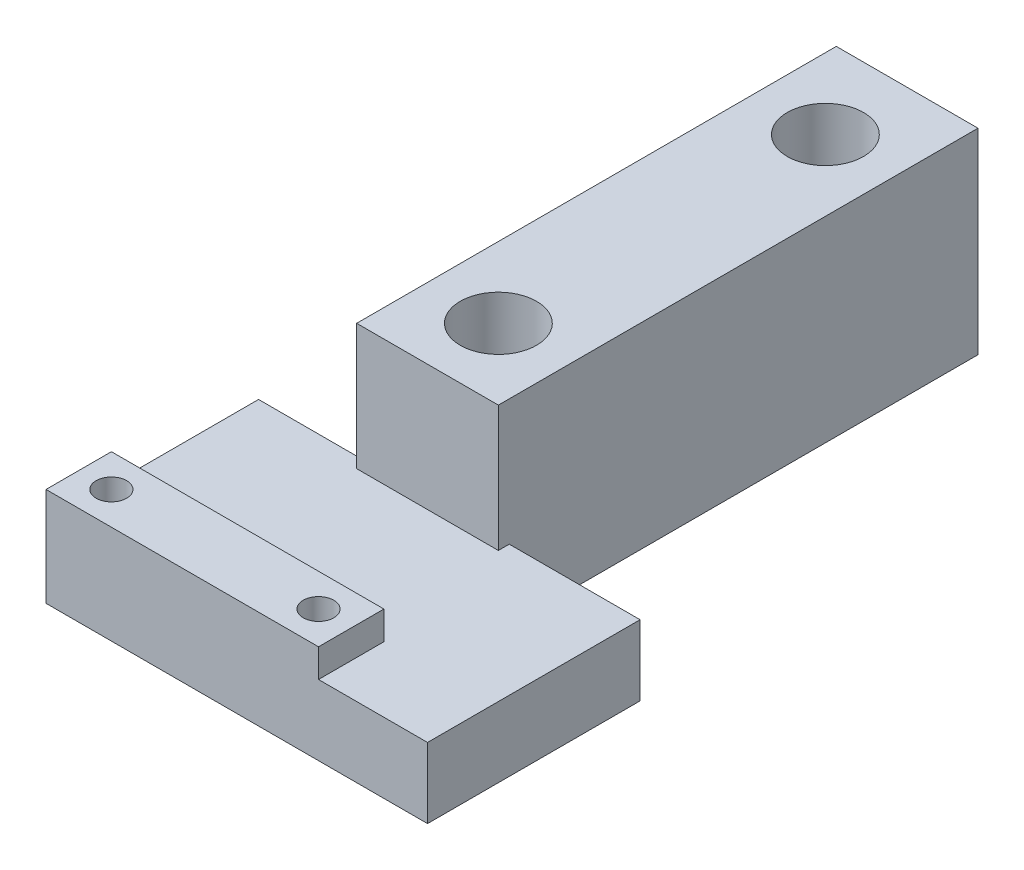
ISO-10303-21;
HEADER;
FILE_DESCRIPTION(('STEP AP214'),'2;1');
FILE_NAME('part.step','',(''),(''),'','','');
FILE_SCHEMA(('AUTOMOTIVE_DESIGN { 1 0 10303 214 1 1 1 1 }'));
ENDSEC;
DATA;
#1=APPLICATION_CONTEXT('core data for automotive mechanical design processes');
#2=APPLICATION_PROTOCOL_DEFINITION('international standard','automotive_design',2000,#1);
#3=PRODUCT_CONTEXT('',#1,'mechanical');
#4=PRODUCT('Part','Part','',(#3));
#5=PRODUCT_RELATED_PRODUCT_CATEGORY('part','',(#4));
#6=PRODUCT_DEFINITION_FORMATION('','',#4);
#7=PRODUCT_DEFINITION_CONTEXT('part definition',#1,'design');
#8=PRODUCT_DEFINITION('design','',#6,#7);
#9=PRODUCT_DEFINITION_SHAPE('','',#8);
#10=(LENGTH_UNIT() NAMED_UNIT(*) SI_UNIT(.MILLI.,.METRE.));
#11=(NAMED_UNIT(*) PLANE_ANGLE_UNIT() SI_UNIT($,.RADIAN.));
#12=(NAMED_UNIT(*) SI_UNIT($,.STERADIAN.) SOLID_ANGLE_UNIT());
#13=UNCERTAINTY_MEASURE_WITH_UNIT(LENGTH_MEASURE(1.E-05),#10,'distance_accuracy_value','');
#14=(GEOMETRIC_REPRESENTATION_CONTEXT(3) GLOBAL_UNCERTAINTY_ASSIGNED_CONTEXT((#13)) GLOBAL_UNIT_ASSIGNED_CONTEXT((#10,
#11,#12)) REPRESENTATION_CONTEXT('',''));
#15=CARTESIAN_POINT('',(0.,0.,0.));
#16=DIRECTION('',(0.,0.,1.));
#17=DIRECTION('',(1.,0.,0.));
#18=AXIS2_PLACEMENT_3D('',#15,#16,#17);
#19=CARTESIAN_POINT('',(0.,6.45,0.));
#20=DIRECTION('',(0.,-1.,0.));
#21=DIRECTION('',(0.,0.,-1.));
#22=AXIS2_PLACEMENT_3D('',#19,#20,#21);
#23=PLANE('',#22);
#24=DIRECTION('',(0.,0.,-1.));
#25=VECTOR('',#24,1.);
#26=CARTESIAN_POINT('',(7.5,6.45,3.75));
#27=LINE('',#26,#25);
#28=CARTESIAN_POINT('',(7.5,6.45,9.75));
#29=VERTEX_POINT('',#28);
#30=CARTESIAN_POINT('',(7.5,6.45,3.75));
#31=VERTEX_POINT('',#30);
#32=EDGE_CURVE('E149',#29,#31,#27,.T.);
#33=ORIENTED_EDGE('',*,*,#32,.F.);
#34=DIRECTION('',(1.,0.,0.));
#35=VECTOR('',#34,1.);
#36=CARTESIAN_POINT('',(-17.5,6.45,9.75));
#37=LINE('',#36,#35);
#38=CARTESIAN_POINT('',(17.5,6.45,9.75));
#39=VERTEX_POINT('',#38);
#40=EDGE_CURVE('E220',#29,#39,#37,.T.);
#41=ORIENTED_EDGE('',*,*,#40,.T.);
#42=DIRECTION('',(0.,0.,-1.));
#43=VECTOR('',#42,1.);
#44=CARTESIAN_POINT('',(17.5,6.45,9.75));
#45=LINE('',#44,#43);
#46=CARTESIAN_POINT('',(17.5,6.45,-9.75));
#47=VERTEX_POINT('',#46);
#48=EDGE_CURVE('E211',#39,#47,#45,.T.);
#49=ORIENTED_EDGE('',*,*,#48,.T.);
#50=DIRECTION('',(-1.,0.,0.));
#51=VECTOR('',#50,1.);
#52=CARTESIAN_POINT('',(-17.5,6.45,-9.75));
#53=LINE('',#52,#51);
#54=CARTESIAN_POINT('',(5.50000000000001,6.45,-9.75));
#55=VERTEX_POINT('',#54);
#56=EDGE_CURVE('E216',#47,#55,#53,.T.);
#57=ORIENTED_EDGE('',*,*,#56,.T.);
#58=DIRECTION('',(0.,0.,-1.));
#59=VECTOR('',#58,1.);
#60=CARTESIAN_POINT('',(5.5,6.45,0.));
#61=LINE('',#60,#59);
#62=CARTESIAN_POINT('',(5.5,6.45,-8.75));
#63=VERTEX_POINT('',#62);
#64=EDGE_CURVE('E204',#63,#55,#61,.T.);
#65=ORIENTED_EDGE('',*,*,#64,.F.);
#66=DIRECTION('',(1.,0.,0.));
#67=VECTOR('',#66,1.);
#68=CARTESIAN_POINT('',(0.,6.45,-8.75));
#69=LINE('',#68,#67);
#70=CARTESIAN_POINT('',(-7.5,6.45,-8.75));
#71=VERTEX_POINT('',#70);
#72=EDGE_CURVE('E195',#71,#63,#69,.T.);
#73=ORIENTED_EDGE('',*,*,#72,.F.);
#74=DIRECTION('',(0.,0.,1.));
#75=VECTOR('',#74,1.);
#76=CARTESIAN_POINT('',(-7.5,6.45,0.));
#77=LINE('',#76,#75);
#78=CARTESIAN_POINT('',(-7.5,6.45,-9.75));
#79=VERTEX_POINT('',#78);
#80=EDGE_CURVE('E198',#79,#71,#77,.T.);
#81=ORIENTED_EDGE('',*,*,#80,.F.);
#82=CARTESIAN_POINT('',(-17.5,6.45,-9.75));
#83=VERTEX_POINT('',#82);
#84=EDGE_CURVE('E214',#79,#83,#53,.T.);
#85=ORIENTED_EDGE('',*,*,#84,.T.);
#86=DIRECTION('',(0.,0.,1.));
#87=VECTOR('',#86,1.);
#88=CARTESIAN_POINT('',(-17.5,6.45,9.75));
#89=LINE('',#88,#87);
#90=CARTESIAN_POINT('',(-17.5,6.45,3.75));
#91=VERTEX_POINT('',#90);
#92=EDGE_CURVE('E53',#83,#91,#89,.T.);
#93=ORIENTED_EDGE('',*,*,#92,.T.);
#94=DIRECTION('',(-1.,0.,0.));
#95=VECTOR('',#94,1.);
#96=CARTESIAN_POINT('',(-17.5,6.45,3.75));
#97=LINE('',#96,#95);
#98=EDGE_CURVE('E48',#31,#91,#97,.T.);
#99=ORIENTED_EDGE('',*,*,#98,.F.);
#100=EDGE_LOOP('',(#33,#41,#49,#57,#65,#73,#81,#85,#93,#99));
#101=FACE_BOUND('',#100,.T.);
#102=ADVANCED_FACE('F33',(#101),#23,.F.);
#103=CARTESIAN_POINT('',(-17.5,6.45,-9.75));
#104=DIRECTION('',(0.,0.,1.));
#105=DIRECTION('',(1.,0.,0.));
#106=AXIS2_PLACEMENT_3D('',#103,#104,#105);
#107=PLANE('',#106);
#108=DIRECTION('',(0.,-1.,0.));
#109=VECTOR('',#108,1.);
#110=CARTESIAN_POINT('',(5.50000000000001,6.45,-9.75));
#111=LINE('',#110,#109);
#112=CARTESIAN_POINT('',(5.50000000000001,0.,-9.75));
#113=VERTEX_POINT('',#112);
#114=EDGE_CURVE('E207',#55,#113,#111,.T.);
#115=ORIENTED_EDGE('',*,*,#114,.F.);
#116=ORIENTED_EDGE('',*,*,#56,.F.);
#117=DIRECTION('',(0.,-1.,0.));
#118=VECTOR('',#117,1.);
#119=CARTESIAN_POINT('',(17.5,6.45,-9.75));
#120=LINE('',#119,#118);
#121=CARTESIAN_POINT('',(17.5,0.,-9.75));
#122=VERTEX_POINT('',#121);
#123=EDGE_CURVE('E11',#47,#122,#120,.T.);
#124=ORIENTED_EDGE('',*,*,#123,.T.);
#125=DIRECTION('',(-1.,0.,0.));
#126=VECTOR('',#125,1.);
#127=CARTESIAN_POINT('',(-17.5,0.,-9.75));
#128=LINE('',#127,#126);
#129=EDGE_CURVE('E226',#122,#113,#128,.T.);
#130=ORIENTED_EDGE('',*,*,#129,.T.);
#131=EDGE_LOOP('',(#115,#116,#124,#130));
#132=FACE_BOUND('',#131,.T.);
#133=ADVANCED_FACE('F293',(#132),#107,.F.);
#134=DIRECTION('',(0.,1.,0.));
#135=VECTOR('',#134,1.);
#136=CARTESIAN_POINT('',(-7.5,6.45,-9.75));
#137=LINE('',#136,#135);
#138=CARTESIAN_POINT('',(-7.5,0.,-9.75));
#139=VERTEX_POINT('',#138);
#140=EDGE_CURVE('E201',#139,#79,#137,.T.);
#141=ORIENTED_EDGE('',*,*,#140,.F.);
#142=CARTESIAN_POINT('',(-17.5,0.,-9.75));
#143=VERTEX_POINT('',#142);
#144=EDGE_CURVE('E225',#139,#143,#128,.T.);
#145=ORIENTED_EDGE('',*,*,#144,.T.);
#146=DIRECTION('',(0.,-1.,0.));
#147=VECTOR('',#146,1.);
#148=CARTESIAN_POINT('',(-17.5,6.45,-9.75));
#149=LINE('',#148,#147);
#150=EDGE_CURVE('E41',#83,#143,#149,.T.);
#151=ORIENTED_EDGE('',*,*,#150,.F.);
#152=ORIENTED_EDGE('',*,*,#84,.F.);
#153=EDGE_LOOP('',(#141,#145,#151,#152));
#154=FACE_BOUND('',#153,.T.);
#155=ADVANCED_FACE('F298',(#154),#107,.F.);
#156=CARTESIAN_POINT('',(17.5,6.45,9.75));
#157=DIRECTION('',(-1.,0.,0.));
#158=DIRECTION('',(0.,0.,1.));
#159=AXIS2_PLACEMENT_3D('',#156,#157,#158);
#160=PLANE('',#159);
#161=DIRECTION('',(0.,0.,-1.));
#162=VECTOR('',#161,1.);
#163=CARTESIAN_POINT('',(17.5,0.,9.75));
#164=LINE('',#163,#162);
#165=CARTESIAN_POINT('',(17.5,0.,9.75));
#166=VERTEX_POINT('',#165);
#167=EDGE_CURVE('E210',#166,#122,#164,.T.);
#168=ORIENTED_EDGE('',*,*,#167,.T.);
#169=ORIENTED_EDGE('',*,*,#123,.F.);
#170=ORIENTED_EDGE('',*,*,#48,.F.);
#171=DIRECTION('',(0.,-1.,0.));
#172=VECTOR('',#171,1.);
#173=CARTESIAN_POINT('',(17.5,6.45,9.75));
#174=LINE('',#173,#172);
#175=EDGE_CURVE('E222',#39,#166,#174,.T.);
#176=ORIENTED_EDGE('',*,*,#175,.T.);
#177=EDGE_LOOP('',(#168,#169,#170,#176));
#178=FACE_BOUND('',#177,.T.);
#179=ADVANCED_FACE('F35',(#178),#160,.F.);
#180=CARTESIAN_POINT('',(-17.5,6.45,9.75));
#181=DIRECTION('',(1.,0.,0.));
#182=DIRECTION('',(0.,0.,-1.));
#183=AXIS2_PLACEMENT_3D('',#180,#181,#182);
#184=PLANE('',#183);
#185=DIRECTION('',(0.,0.,1.));
#186=VECTOR('',#185,1.);
#187=CARTESIAN_POINT('',(-17.5,0.,9.75));
#188=LINE('',#187,#186);
#189=CARTESIAN_POINT('',(-17.5,0.,9.75));
#190=VERTEX_POINT('',#189);
#191=EDGE_CURVE('E228',#143,#190,#188,.T.);
#192=ORIENTED_EDGE('',*,*,#191,.T.);
#193=DIRECTION('',(0.,-1.,0.));
#194=VECTOR('',#193,1.);
#195=CARTESIAN_POINT('',(-17.5,6.45,9.75));
#196=LINE('',#195,#194);
#197=CARTESIAN_POINT('',(-17.5,9.05,9.75));
#198=VERTEX_POINT('',#197);
#199=EDGE_CURVE('E233',#198,#190,#196,.T.);
#200=ORIENTED_EDGE('',*,*,#199,.F.);
#201=DIRECTION('',(0.,0.,1.));
#202=VECTOR('',#201,1.);
#203=CARTESIAN_POINT('',(-17.5,9.05,3.75));
#204=LINE('',#203,#202);
#205=CARTESIAN_POINT('',(-17.5,9.05,3.75));
#206=VERTEX_POINT('',#205);
#207=EDGE_CURVE('E137',#206,#198,#204,.T.);
#208=ORIENTED_EDGE('',*,*,#207,.F.);
#209=DIRECTION('',(0.,-1.,0.));
#210=VECTOR('',#209,1.);
#211=CARTESIAN_POINT('',(-17.5,9.05,3.75));
#212=LINE('',#211,#210);
#213=EDGE_CURVE('E133',#206,#91,#212,.T.);
#214=ORIENTED_EDGE('',*,*,#213,.T.);
#215=ORIENTED_EDGE('',*,*,#92,.F.);
#216=ORIENTED_EDGE('',*,*,#150,.T.);
#217=EDGE_LOOP('',(#192,#200,#208,#214,#215,#216));
#218=FACE_BOUND('',#217,.T.);
#219=ADVANCED_FACE('F239',(#218),#184,.F.);
#220=CARTESIAN_POINT('',(-17.5,6.45,9.75));
#221=DIRECTION('',(0.,0.,-1.));
#222=DIRECTION('',(-1.,0.,0.));
#223=AXIS2_PLACEMENT_3D('',#220,#221,#222);
#224=PLANE('',#223);
#225=DIRECTION('',(1.,0.,0.));
#226=VECTOR('',#225,1.);
#227=CARTESIAN_POINT('',(-17.5,0.,9.75));
#228=LINE('',#227,#226);
#229=EDGE_CURVE('E215',#190,#166,#228,.T.);
#230=ORIENTED_EDGE('',*,*,#229,.T.);
#231=ORIENTED_EDGE('',*,*,#175,.F.);
#232=ORIENTED_EDGE('',*,*,#40,.F.);
#233=DIRECTION('',(0.,-1.,0.));
#234=VECTOR('',#233,1.);
#235=CARTESIAN_POINT('',(7.5,9.05,9.75));
#236=LINE('',#235,#234);
#237=CARTESIAN_POINT('',(7.5,9.05,9.75));
#238=VERTEX_POINT('',#237);
#239=EDGE_CURVE('E155',#238,#29,#236,.T.);
#240=ORIENTED_EDGE('',*,*,#239,.F.);
#241=DIRECTION('',(1.,0.,0.));
#242=VECTOR('',#241,1.);
#243=CARTESIAN_POINT('',(-17.5,9.05,9.75));
#244=LINE('',#243,#242);
#245=EDGE_CURVE('E143',#198,#238,#244,.T.);
#246=ORIENTED_EDGE('',*,*,#245,.F.);
#247=ORIENTED_EDGE('',*,*,#199,.T.);
#248=EDGE_LOOP('',(#230,#231,#232,#240,#246,#247));
#249=FACE_BOUND('',#248,.T.);
#250=ADVANCED_FACE('F250',(#249),#224,.F.);
#251=CARTESIAN_POINT('',(0.,0.,0.));
#252=DIRECTION('',(0.,-1.,0.));
#253=DIRECTION('',(0.,0.,-1.));
#254=AXIS2_PLACEMENT_3D('',#251,#252,#253);
#255=PLANE('',#254);
#256=CARTESIAN_POINT('',(4.5,0.,6.75));
#257=DIRECTION('',(0.,1.,0.));
#258=DIRECTION('',(0.,0.,1.));
#259=AXIS2_PLACEMENT_3D('',#256,#257,#258);
#260=CIRCLE('',#259,1.4);
#261=CARTESIAN_POINT('',(4.5,0.,8.15));
#262=VERTEX_POINT('',#261);
#263=EDGE_CURVE('E263',#262,#262,#260,.T.);
#264=ORIENTED_EDGE('',*,*,#263,.T.);
#265=EDGE_LOOP('',(#264));
#266=FACE_BOUND('',#265,.T.);
#267=CARTESIAN_POINT('',(-14.5,0.,6.75));
#268=DIRECTION('',(0.,1.,0.));
#269=DIRECTION('',(0.,0.,1.));
#270=AXIS2_PLACEMENT_3D('',#267,#268,#269);
#271=CIRCLE('',#270,1.4);
#272=CARTESIAN_POINT('',(-14.5,0.,8.15));
#273=VERTEX_POINT('',#272);
#274=EDGE_CURVE('E257',#273,#273,#271,.T.);
#275=ORIENTED_EDGE('',*,*,#274,.T.);
#276=EDGE_LOOP('',(#275));
#277=FACE_BOUND('',#276,.T.);
#278=CARTESIAN_POINT('',(-1.,0.,-15.25));
#279=DIRECTION('',(0.,1.,0.));
#280=DIRECTION('',(0.,0.,1.));
#281=AXIS2_PLACEMENT_3D('',#278,#279,#280);
#282=CIRCLE('',#281,3.5);
#283=CARTESIAN_POINT('',(-1.,0.,-11.75));
#284=VERTEX_POINT('',#283);
#285=EDGE_CURVE('E153',#284,#284,#282,.T.);
#286=ORIENTED_EDGE('',*,*,#285,.T.);
#287=EDGE_LOOP('',(#286));
#288=FACE_BOUND('',#287,.T.);
#289=CARTESIAN_POINT('',(-1.,0.,-45.25));
#290=DIRECTION('',(0.,1.,0.));
#291=DIRECTION('',(0.,0.,1.));
#292=AXIS2_PLACEMENT_3D('',#289,#290,#291);
#293=CIRCLE('',#292,3.5);
#294=CARTESIAN_POINT('',(-1.,0.,-41.75));
#295=VERTEX_POINT('',#294);
#296=EDGE_CURVE('E162',#295,#295,#293,.T.);
#297=ORIENTED_EDGE('',*,*,#296,.T.);
#298=EDGE_LOOP('',(#297));
#299=FACE_BOUND('',#298,.T.);
#300=ORIENTED_EDGE('',*,*,#144,.F.);
#301=DIRECTION('',(0.,0.,1.));
#302=VECTOR('',#301,1.);
#303=CARTESIAN_POINT('',(-7.5,0.,-52.75));
#304=LINE('',#303,#302);
#305=CARTESIAN_POINT('',(-7.5,0.,-52.75));
#306=VERTEX_POINT('',#305);
#307=EDGE_CURVE('E172',#306,#139,#304,.T.);
#308=ORIENTED_EDGE('',*,*,#307,.F.);
#309=DIRECTION('',(-1.,0.,0.));
#310=VECTOR('',#309,1.);
#311=CARTESIAN_POINT('',(-7.5,0.,-52.75));
#312=LINE('',#311,#310);
#313=CARTESIAN_POINT('',(5.5,0.,-52.75));
#314=VERTEX_POINT('',#313);
#315=EDGE_CURVE('E180',#314,#306,#312,.T.);
#316=ORIENTED_EDGE('',*,*,#315,.F.);
#317=DIRECTION('',(0.,0.,-1.));
#318=VECTOR('',#317,1.);
#319=CARTESIAN_POINT('',(5.5,0.,-52.75));
#320=LINE('',#319,#318);
#321=EDGE_CURVE('E165',#113,#314,#320,.T.);
#322=ORIENTED_EDGE('',*,*,#321,.F.);
#323=ORIENTED_EDGE('',*,*,#129,.F.);
#324=ORIENTED_EDGE('',*,*,#167,.F.);
#325=ORIENTED_EDGE('',*,*,#229,.F.);
#326=ORIENTED_EDGE('',*,*,#191,.F.);
#327=EDGE_LOOP('',(#300,#308,#316,#322,#323,#324,#325,#326));
#328=FACE_BOUND('',#327,.T.);
#329=ADVANCED_FACE('F245',(#266,#277,#288,#299,#328),#255,.T.);
#330=CARTESIAN_POINT('',(5.5,18.,-52.75));
#331=DIRECTION('',(-1.,0.,0.));
#332=DIRECTION('',(0.,0.,1.));
#333=AXIS2_PLACEMENT_3D('',#330,#331,#332);
#334=PLANE('',#333);
#335=ORIENTED_EDGE('',*,*,#64,.T.);
#336=ORIENTED_EDGE('',*,*,#114,.T.);
#337=ORIENTED_EDGE('',*,*,#321,.T.);
#338=DIRECTION('',(0.,-1.,0.));
#339=VECTOR('',#338,1.);
#340=CARTESIAN_POINT('',(5.5,18.,-52.75));
#341=LINE('',#340,#339);
#342=CARTESIAN_POINT('',(5.5,18.,-52.75));
#343=VERTEX_POINT('',#342);
#344=EDGE_CURVE('E192',#343,#314,#341,.T.);
#345=ORIENTED_EDGE('',*,*,#344,.F.);
#346=DIRECTION('',(0.,0.,-1.));
#347=VECTOR('',#346,1.);
#348=CARTESIAN_POINT('',(5.5,18.,-52.75));
#349=LINE('',#348,#347);
#350=CARTESIAN_POINT('',(5.5,18.,-8.75));
#351=VERTEX_POINT('',#350);
#352=EDGE_CURVE('E168',#351,#343,#349,.T.);
#353=ORIENTED_EDGE('',*,*,#352,.F.);
#354=DIRECTION('',(0.,-1.,0.));
#355=VECTOR('',#354,1.);
#356=CARTESIAN_POINT('',(5.5,18.,-8.75));
#357=LINE('',#356,#355);
#358=EDGE_CURVE('E178',#351,#63,#357,.T.);
#359=ORIENTED_EDGE('',*,*,#358,.T.);
#360=EDGE_LOOP('',(#335,#336,#337,#345,#353,#359));
#361=FACE_BOUND('',#360,.T.);
#362=ADVANCED_FACE('F302',(#361),#334,.F.);
#363=CARTESIAN_POINT('',(-7.5,18.,-52.75));
#364=DIRECTION('',(1.,0.,0.));
#365=DIRECTION('',(0.,0.,-1.));
#366=AXIS2_PLACEMENT_3D('',#363,#364,#365);
#367=PLANE('',#366);
#368=ORIENTED_EDGE('',*,*,#307,.T.);
#369=ORIENTED_EDGE('',*,*,#140,.T.);
#370=ORIENTED_EDGE('',*,*,#80,.T.);
#371=DIRECTION('',(0.,-1.,0.));
#372=VECTOR('',#371,1.);
#373=CARTESIAN_POINT('',(-7.5,18.,-8.75));
#374=LINE('',#373,#372);
#375=CARTESIAN_POINT('',(-7.5,18.,-8.75));
#376=VERTEX_POINT('',#375);
#377=EDGE_CURVE('E186',#376,#71,#374,.T.);
#378=ORIENTED_EDGE('',*,*,#377,.F.);
#379=DIRECTION('',(0.,0.,1.));
#380=VECTOR('',#379,1.);
#381=CARTESIAN_POINT('',(-7.5,18.,-52.75));
#382=LINE('',#381,#380);
#383=CARTESIAN_POINT('',(-7.5,18.,-52.75));
#384=VERTEX_POINT('',#383);
#385=EDGE_CURVE('E174',#384,#376,#382,.T.);
#386=ORIENTED_EDGE('',*,*,#385,.F.);
#387=DIRECTION('',(0.,-1.,0.));
#388=VECTOR('',#387,1.);
#389=CARTESIAN_POINT('',(-7.5,18.,-52.75));
#390=LINE('',#389,#388);
#391=EDGE_CURVE('E189',#384,#306,#390,.T.);
#392=ORIENTED_EDGE('',*,*,#391,.T.);
#393=EDGE_LOOP('',(#368,#369,#370,#378,#386,#392));
#394=FACE_BOUND('',#393,.T.);
#395=ADVANCED_FACE('F318',(#394),#367,.F.);
#396=CARTESIAN_POINT('',(-7.5,18.,-8.75));
#397=DIRECTION('',(0.,0.,-1.));
#398=DIRECTION('',(-1.,0.,0.));
#399=AXIS2_PLACEMENT_3D('',#396,#397,#398);
#400=PLANE('',#399);
#401=ORIENTED_EDGE('',*,*,#377,.T.);
#402=ORIENTED_EDGE('',*,*,#72,.T.);
#403=ORIENTED_EDGE('',*,*,#358,.F.);
#404=DIRECTION('',(1.,0.,0.));
#405=VECTOR('',#404,1.);
#406=CARTESIAN_POINT('',(-7.5,18.,-8.75));
#407=LINE('',#406,#405);
#408=EDGE_CURVE('E176',#376,#351,#407,.T.);
#409=ORIENTED_EDGE('',*,*,#408,.F.);
#410=EDGE_LOOP('',(#401,#402,#403,#409));
#411=FACE_BOUND('',#410,.T.);
#412=ADVANCED_FACE('F331',(#411),#400,.F.);
#413=CARTESIAN_POINT('',(-7.5,18.,-52.75));
#414=DIRECTION('',(0.,0.,1.));
#415=DIRECTION('',(1.,0.,0.));
#416=AXIS2_PLACEMENT_3D('',#413,#414,#415);
#417=PLANE('',#416);
#418=ORIENTED_EDGE('',*,*,#315,.T.);
#419=ORIENTED_EDGE('',*,*,#391,.F.);
#420=DIRECTION('',(-1.,0.,0.));
#421=VECTOR('',#420,1.);
#422=CARTESIAN_POINT('',(-7.5,18.,-52.75));
#423=LINE('',#422,#421);
#424=EDGE_CURVE('E171',#343,#384,#423,.T.);
#425=ORIENTED_EDGE('',*,*,#424,.F.);
#426=ORIENTED_EDGE('',*,*,#344,.T.);
#427=EDGE_LOOP('',(#418,#419,#425,#426));
#428=FACE_BOUND('',#427,.T.);
#429=ADVANCED_FACE('F326',(#428),#417,.F.);
#430=CARTESIAN_POINT('',(0.,18.,0.));
#431=DIRECTION('',(0.,1.,0.));
#432=DIRECTION('',(0.,0.,1.));
#433=AXIS2_PLACEMENT_3D('',#430,#431,#432);
#434=PLANE('',#433);
#435=CARTESIAN_POINT('',(-1.,18.,-15.25));
#436=DIRECTION('',(0.,1.,0.));
#437=DIRECTION('',(0.,0.,1.));
#438=AXIS2_PLACEMENT_3D('',#435,#436,#437);
#439=CIRCLE('',#438,3.5);
#440=CARTESIAN_POINT('',(-1.,18.,-11.75));
#441=VERTEX_POINT('',#440);
#442=EDGE_CURVE('E150',#441,#441,#439,.T.);
#443=ORIENTED_EDGE('',*,*,#442,.F.);
#444=EDGE_LOOP('',(#443));
#445=FACE_BOUND('',#444,.T.);
#446=CARTESIAN_POINT('',(-1.,18.,-45.25));
#447=DIRECTION('',(0.,1.,0.));
#448=DIRECTION('',(0.,0.,1.));
#449=AXIS2_PLACEMENT_3D('',#446,#447,#448);
#450=CIRCLE('',#449,3.5);
#451=CARTESIAN_POINT('',(-1.,18.,-41.75));
#452=VERTEX_POINT('',#451);
#453=EDGE_CURVE('E160',#452,#452,#450,.T.);
#454=ORIENTED_EDGE('',*,*,#453,.F.);
#455=EDGE_LOOP('',(#454));
#456=FACE_BOUND('',#455,.T.);
#457=ORIENTED_EDGE('',*,*,#352,.T.);
#458=ORIENTED_EDGE('',*,*,#424,.T.);
#459=ORIENTED_EDGE('',*,*,#385,.T.);
#460=ORIENTED_EDGE('',*,*,#408,.T.);
#461=EDGE_LOOP('',(#457,#458,#459,#460));
#462=FACE_BOUND('',#461,.T.);
#463=ADVANCED_FACE('F334',(#445,#456,#462),#434,.T.);
#464=CARTESIAN_POINT('',(-1.,0.,-45.25));
#465=DIRECTION('',(0.,1.,0.));
#466=DIRECTION('',(0.,0.,1.));
#467=AXIS2_PLACEMENT_3D('',#464,#465,#466);
#468=CYLINDRICAL_SURFACE('',#467,3.5);
#469=ORIENTED_EDGE('',*,*,#296,.F.);
#470=EDGE_LOOP('',(#469));
#471=FACE_BOUND('',#470,.T.);
#472=ORIENTED_EDGE('',*,*,#453,.T.);
#473=EDGE_LOOP('',(#472));
#474=FACE_BOUND('',#473,.T.);
#475=ADVANCED_FACE('F336',(#471,#474),#468,.F.);
#476=CARTESIAN_POINT('',(-1.,0.,-15.25));
#477=DIRECTION('',(0.,1.,0.));
#478=DIRECTION('',(0.,0.,1.));
#479=AXIS2_PLACEMENT_3D('',#476,#477,#478);
#480=CYLINDRICAL_SURFACE('',#479,3.5);
#481=ORIENTED_EDGE('',*,*,#285,.F.);
#482=EDGE_LOOP('',(#481));
#483=FACE_BOUND('',#482,.T.);
#484=ORIENTED_EDGE('',*,*,#442,.T.);
#485=EDGE_LOOP('',(#484));
#486=FACE_BOUND('',#485,.T.);
#487=ADVANCED_FACE('F343',(#483,#486),#480,.F.);
#488=CARTESIAN_POINT('',(7.5,9.05,3.75));
#489=DIRECTION('',(-1.,0.,0.));
#490=DIRECTION('',(0.,0.,1.));
#491=AXIS2_PLACEMENT_3D('',#488,#489,#490);
#492=PLANE('',#491);
#493=ORIENTED_EDGE('',*,*,#32,.T.);
#494=DIRECTION('',(0.,-1.,0.));
#495=VECTOR('',#494,1.);
#496=CARTESIAN_POINT('',(7.5,9.05,3.75));
#497=LINE('',#496,#495);
#498=CARTESIAN_POINT('',(7.5,9.05,3.75));
#499=VERTEX_POINT('',#498);
#500=EDGE_CURVE('E130',#499,#31,#497,.T.);
#501=ORIENTED_EDGE('',*,*,#500,.F.);
#502=DIRECTION('',(0.,0.,-1.));
#503=VECTOR('',#502,1.);
#504=CARTESIAN_POINT('',(7.5,9.05,3.75));
#505=LINE('',#504,#503);
#506=EDGE_CURVE('E138',#238,#499,#505,.T.);
#507=ORIENTED_EDGE('',*,*,#506,.F.);
#508=ORIENTED_EDGE('',*,*,#239,.T.);
#509=EDGE_LOOP('',(#493,#501,#507,#508));
#510=FACE_BOUND('',#509,.T.);
#511=ADVANCED_FACE('F148',(#510),#492,.F.);
#512=CARTESIAN_POINT('',(-17.5,9.05,3.75));
#513=DIRECTION('',(0.,0.,1.));
#514=DIRECTION('',(1.,0.,0.));
#515=AXIS2_PLACEMENT_3D('',#512,#513,#514);
#516=PLANE('',#515);
#517=ORIENTED_EDGE('',*,*,#98,.T.);
#518=ORIENTED_EDGE('',*,*,#213,.F.);
#519=DIRECTION('',(-1.,0.,0.));
#520=VECTOR('',#519,1.);
#521=CARTESIAN_POINT('',(-17.5,9.05,3.75));
#522=LINE('',#521,#520);
#523=EDGE_CURVE('E126',#499,#206,#522,.T.);
#524=ORIENTED_EDGE('',*,*,#523,.F.);
#525=ORIENTED_EDGE('',*,*,#500,.T.);
#526=EDGE_LOOP('',(#517,#518,#524,#525));
#527=FACE_BOUND('',#526,.T.);
#528=ADVANCED_FACE('F128',(#527),#516,.F.);
#529=CARTESIAN_POINT('',(0.,9.05,0.));
#530=DIRECTION('',(0.,1.,0.));
#531=DIRECTION('',(0.,0.,1.));
#532=AXIS2_PLACEMENT_3D('',#529,#530,#531);
#533=PLANE('',#532);
#534=CARTESIAN_POINT('',(4.5,9.05,6.75));
#535=DIRECTION('',(0.,1.,0.));
#536=DIRECTION('',(0.,0.,1.));
#537=AXIS2_PLACEMENT_3D('',#534,#535,#536);
#538=CIRCLE('',#537,1.4);
#539=CARTESIAN_POINT('',(4.5,9.05,8.15));
#540=VERTEX_POINT('',#539);
#541=EDGE_CURVE('E266',#540,#540,#538,.T.);
#542=ORIENTED_EDGE('',*,*,#541,.F.);
#543=EDGE_LOOP('',(#542));
#544=FACE_BOUND('',#543,.T.);
#545=CARTESIAN_POINT('',(-14.5,9.05,6.75));
#546=DIRECTION('',(0.,1.,0.));
#547=DIRECTION('',(0.,0.,1.));
#548=AXIS2_PLACEMENT_3D('',#545,#546,#547);
#549=CIRCLE('',#548,1.4);
#550=CARTESIAN_POINT('',(-14.5,9.05,8.15));
#551=VERTEX_POINT('',#550);
#552=EDGE_CURVE('E260',#551,#551,#549,.T.);
#553=ORIENTED_EDGE('',*,*,#552,.F.);
#554=EDGE_LOOP('',(#553));
#555=FACE_BOUND('',#554,.T.);
#556=ORIENTED_EDGE('',*,*,#506,.T.);
#557=ORIENTED_EDGE('',*,*,#523,.T.);
#558=ORIENTED_EDGE('',*,*,#207,.T.);
#559=ORIENTED_EDGE('',*,*,#245,.T.);
#560=EDGE_LOOP('',(#556,#557,#558,#559));
#561=FACE_BOUND('',#560,.T.);
#562=ADVANCED_FACE('F141',(#544,#555,#561),#533,.T.);
#563=CARTESIAN_POINT('',(-14.5,0.,6.75));
#564=DIRECTION('',(0.,1.,0.));
#565=DIRECTION('',(0.,0.,1.));
#566=AXIS2_PLACEMENT_3D('',#563,#564,#565);
#567=CYLINDRICAL_SURFACE('',#566,1.4);
#568=ORIENTED_EDGE('',*,*,#274,.F.);
#569=EDGE_LOOP('',(#568));
#570=FACE_BOUND('',#569,.T.);
#571=ORIENTED_EDGE('',*,*,#552,.T.);
#572=EDGE_LOOP('',(#571));
#573=FACE_BOUND('',#572,.T.);
#574=ADVANCED_FACE('F277',(#570,#573),#567,.F.);
#575=CARTESIAN_POINT('',(4.5,0.,6.75));
#576=DIRECTION('',(0.,1.,0.));
#577=DIRECTION('',(0.,0.,1.));
#578=AXIS2_PLACEMENT_3D('',#575,#576,#577);
#579=CYLINDRICAL_SURFACE('',#578,1.4);
#580=ORIENTED_EDGE('',*,*,#263,.F.);
#581=EDGE_LOOP('',(#580));
#582=FACE_BOUND('',#581,.T.);
#583=ORIENTED_EDGE('',*,*,#541,.T.);
#584=EDGE_LOOP('',(#583));
#585=FACE_BOUND('',#584,.T.);
#586=ADVANCED_FACE('F274',(#582,#585),#579,.F.);
#587=CLOSED_SHELL('',(#102,#133,#155,#179,#219,#250,#329,#362,#395,#412,#429,#463,#475,#487,
#511,#528,#562,#574,#586));
#588=MANIFOLD_SOLID_BREP('B2',#587);
#589=ADVANCED_BREP_SHAPE_REPRESENTATION('',(#18,#588),#14);
#590=SHAPE_DEFINITION_REPRESENTATION(#9,#589);
ENDSEC;
END-ISO-10303-21;
